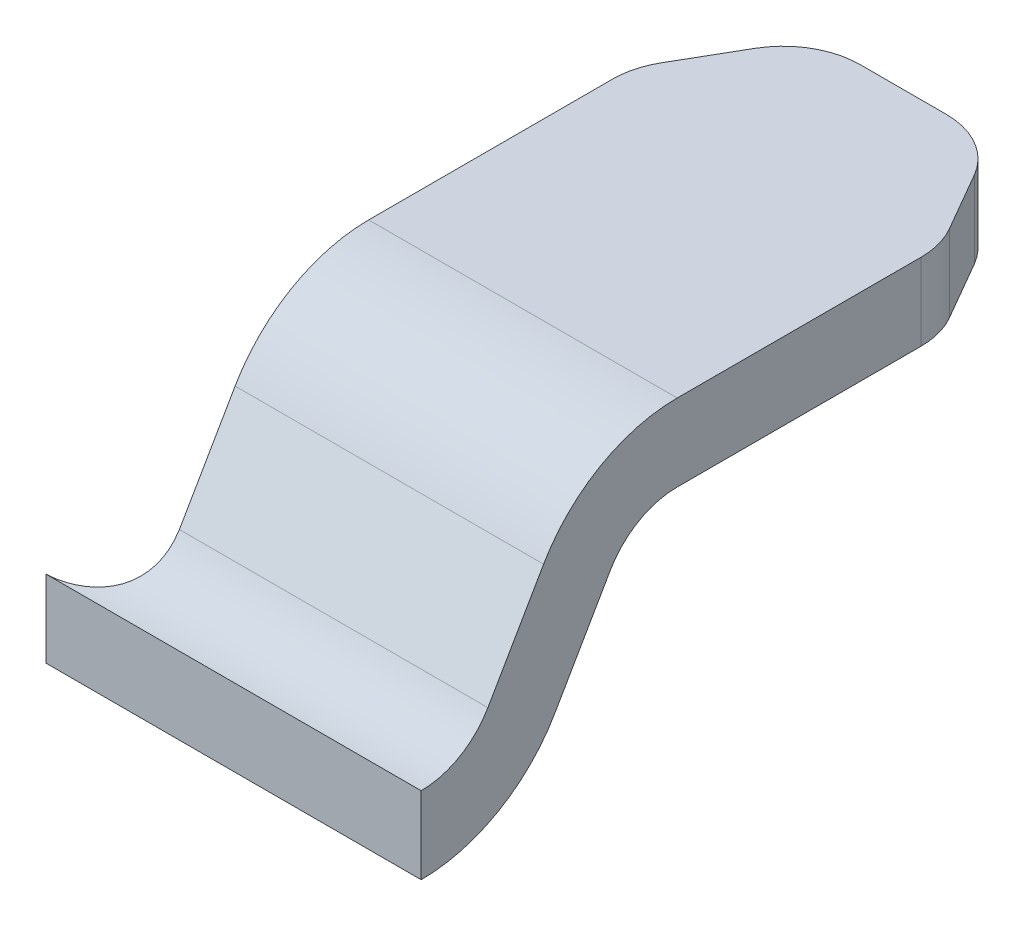
ISO-10303-21;
HEADER;
FILE_DESCRIPTION(('STEP AP214'),'2;1');
FILE_NAME('part.step','',(''),(''),'','','');
FILE_SCHEMA(('AUTOMOTIVE_DESIGN { 1 0 10303 214 1 1 1 1 }'));
ENDSEC;
DATA;
#1=APPLICATION_CONTEXT('core data for automotive mechanical design processes');
#2=APPLICATION_PROTOCOL_DEFINITION('international standard','automotive_design',2000,#1);
#3=PRODUCT_CONTEXT('',#1,'mechanical');
#4=PRODUCT('Part','Part','',(#3));
#5=PRODUCT_RELATED_PRODUCT_CATEGORY('part','',(#4));
#6=PRODUCT_DEFINITION_FORMATION('','',#4);
#7=PRODUCT_DEFINITION_CONTEXT('part definition',#1,'design');
#8=PRODUCT_DEFINITION('design','',#6,#7);
#9=PRODUCT_DEFINITION_SHAPE('','',#8);
#10=(LENGTH_UNIT() NAMED_UNIT(*) SI_UNIT(.MILLI.,.METRE.));
#11=(NAMED_UNIT(*) PLANE_ANGLE_UNIT() SI_UNIT($,.RADIAN.));
#12=(NAMED_UNIT(*) SI_UNIT($,.STERADIAN.) SOLID_ANGLE_UNIT());
#13=UNCERTAINTY_MEASURE_WITH_UNIT(LENGTH_MEASURE(1.E-05),#10,'distance_accuracy_value','');
#14=(GEOMETRIC_REPRESENTATION_CONTEXT(3) GLOBAL_UNCERTAINTY_ASSIGNED_CONTEXT((#13)) GLOBAL_UNIT_ASSIGNED_CONTEXT((#10,
#11,#12)) REPRESENTATION_CONTEXT('',''));
#15=CARTESIAN_POINT('',(0.,0.,0.));
#16=DIRECTION('',(0.,0.,1.));
#17=DIRECTION('',(1.,0.,0.));
#18=AXIS2_PLACEMENT_3D('',#15,#16,#17);
#19=CARTESIAN_POINT('',(-8.499968942605,3.500000000009,-3.65014050948));
#20=DIRECTION('',(0.,-2.126490095122E-11,1.));
#21=DIRECTION('',(0.,-1.,-2.126490095122E-11));
#22=AXIS2_PLACEMENT_3D('',#19,#20,#21);
#23=PLANE('',#22);
#24=DIRECTION('',(-2.263504939037E-11,1.,0.));
#25=VECTOR('',#24,1.);
#26=CARTESIAN_POINT('',(-8.499968942605,3.500000000008,-3.650140509429));
#27=LINE('',#26,#25);
#28=CARTESIAN_POINT('',(-8.49996894266812,5.95000004938576,-3.650140509429));
#29=VERTEX_POINT('',#28);
#30=CARTESIAN_POINT('',(-8.49996894266426,5.75000002470708,-3.650140509429));
#31=VERTEX_POINT('',#30);
#32=EDGE_CURVE('E410',#29,#31,#27,.F.);
#33=ORIENTED_EDGE('',*,*,#32,.F.);
#34=DIRECTION('',(-1.,-3.551554605963E-11,1.351452283416E-12));
#35=VECTOR('',#34,1.);
#36=CARTESIAN_POINT('',(-6.3999689427069,5.95000004946034,-3.65014050943184));
#37=LINE('',#36,#35);
#38=CARTESIAN_POINT('',(-9.47285812874747,5.9500000493512,-3.6501405094277));
#39=VERTEX_POINT('',#38);
#40=EDGE_CURVE('E439',#29,#39,#37,.T.);
#41=ORIENTED_EDGE('',*,*,#40,.T.);
#42=DIRECTION('',(-2.263504939037E-11,1.,2.126490095122E-11));
#43=VECTOR('',#42,1.);
#44=CARTESIAN_POINT('',(-9.47285812869157,3.49999999994734,-3.65014050947982));
#45=LINE('',#44,#43);
#46=CARTESIAN_POINT('',(-9.47285812879673,5.75000002467253,-3.65014050942983));
#47=VERTEX_POINT('',#46);
#48=EDGE_CURVE('E157',#39,#47,#45,.F.);
#49=ORIENTED_EDGE('',*,*,#48,.T.);
#50=DIRECTION('',(-1.,-3.551554605963E-11,1.351452283416E-12));
#51=VECTOR('',#50,1.);
#52=CARTESIAN_POINT('',(-6.39996894269979,5.75000002478167,-3.65014050943184));
#53=LINE('',#52,#51);
#54=EDGE_CURVE('E158',#31,#47,#53,.T.);
#55=ORIENTED_EDGE('',*,*,#54,.F.);
#56=EDGE_LOOP('',(#33,#41,#49,#55));
#57=FACE_BOUND('',#56,.T.);
#58=ADVANCED_FACE('F17',(#57),#23,.T.);
#59=CARTESIAN_POINT('',(-6.399968942714,6.150000000103,-3.649999999884));
#60=DIRECTION('',(-1.,-3.551554605963E-11,1.351452283416E-12));
#61=DIRECTION('',(3.551554605963E-11,-1.,0.));
#62=AXIS2_PLACEMENT_3D('',#59,#60,#61);
#63=CYLINDRICAL_SURFACE('',#62,0.2);
#64=CARTESIAN_POINT('',(-8.49996894268032,6.15000000002842,-3.64999999988116));
#65=DIRECTION('',(-1.,-3.551554605963E-11,1.351452283416E-12));
#66=DIRECTION('',(3.551554605963E-11,-1.,0.));
#67=AXIS2_PLACEMENT_3D('',#64,#65,#66);
#68=CIRCLE('',#67,0.2);
#69=CARTESIAN_POINT('',(-8.49996894266986,6.0500000000187,-3.82320508063239));
#70=VERTEX_POINT('',#69);
#71=EDGE_CURVE('E143',#70,#29,#68,.T.);
#72=ORIENTED_EDGE('',*,*,#71,.F.);
#73=DIRECTION('',(1.,8.29369051018556E-12,1.43650933458926E-11));
#74=VECTOR('',#73,1.);
#75=CARTESIAN_POINT('',(-6.399968942714,6.05000000002613,-3.82320508059621));
#76=LINE('',#75,#74);
#77=CARTESIAN_POINT('',(-9.3000972409636,6.05000000000201,-3.82320508063798));
#78=VERTEX_POINT('',#77);
#79=EDGE_CURVE('E137',#78,#70,#76,.T.);
#80=ORIENTED_EDGE('',*,*,#79,.F.);
#81=CARTESIAN_POINT('',(-9.3000972409636,6.05000000000194,-3.82320508063809));
#82=CARTESIAN_POINT('',(-9.30027779439035,6.04180177501271,-3.81848809116702));
#83=CARTESIAN_POINT('',(-9.30066283096507,6.03393993950661,-3.81315869651857));
#84=CARTESIAN_POINT('',(-9.30214723236842,6.01904413826436,-3.80145713343584));
#85=CARTESIAN_POINT('',(-9.3032504915967,6.01201493433625,-3.79507942250675));
#86=CARTESIAN_POINT('',(-9.30649046032377,5.99899691891083,-3.78148134066467));
#87=CARTESIAN_POINT('',(-9.30863295384659,5.99301418836033,-3.77425642722463));
#88=CARTESIAN_POINT('',(-9.3142023002448,5.98232745372478,-3.75940348178767));
#89=CARTESIAN_POINT('',(-9.31762437883303,5.97761880706601,-3.75177703771975));
#90=CARTESIAN_POINT('',(-9.32542139363572,5.96994317187639,-3.73740073780641));
#91=CARTESIAN_POINT('',(-9.32965501973012,5.96684365907458,-3.73064448068721));
#92=CARTESIAN_POINT('',(-9.3392030952169,5.9616108061845,-3.71752405957299));
#93=CARTESIAN_POINT('',(-9.34451865348358,5.95947846464923,-3.7111603066462));
#94=CARTESIAN_POINT('',(-9.35592005902885,5.9560814143098,-3.69931966641387));
#95=CARTESIAN_POINT('',(-9.36197591301185,5.95479119005982,-3.69382095875209));
#96=CARTESIAN_POINT('',(-9.37483738683615,5.95278523118169,-3.68366281258479));
#97=CARTESIAN_POINT('',(-9.38164317311375,5.95206962437452,-3.67900356099108));
#98=CARTESIAN_POINT('',(-9.39658011011515,5.95097066746392,-3.67022236671521));
#99=CARTESIAN_POINT('',(-9.40477558921807,5.95062901378787,-3.66620482906179));
#100=CARTESIAN_POINT('',(-9.42168455453759,5.95019483442756,-3.65945448749895));
#101=CARTESIAN_POINT('',(-9.43039795717187,5.95010226865656,-3.65672147692365));
#102=CARTESIAN_POINT('',(-9.44478047300794,5.95002455662212,-3.65338200668173));
#103=CARTESIAN_POINT('',(-9.45035692253173,5.95001204890543,-3.65236224213044));
#104=CARTESIAN_POINT('',(-9.46157083672554,5.95000087516357,-3.65085347021189));
#105=CARTESIAN_POINT('',(-9.46720817176206,5.95000218396852,-3.65036349950232));
#106=CARTESIAN_POINT('',(-9.47285812874703,5.9500000493512,-3.65014050942772));
#107=B_SPLINE_CURVE_WITH_KNOTS('',3,(#81,#82,#83,#84,#85,#86,#87,#88,#89,#90,#91,#92,#93,#94,
#95,#96,#97,#98,#99,#100,#101,#102,#103,#104,#105,#106),.UNSPECIFIED.,.F.,.F.,(4,2,2,2,2,2,2,2,
2,2,2,2,4),(0.,0.0283828798518243,0.0569209558912545,0.0856197199951394,0.114212457001874,
0.139742802926123,0.165299447910802,0.190040561555783,0.214787177223679,0.242076610262615,
0.26936165123619,0.286345287766869,0.303297990165134),.UNSPECIFIED.);
#108=EDGE_CURVE('E20',#78,#39,#107,.T.);
#109=ORIENTED_EDGE('',*,*,#108,.T.);
#110=ORIENTED_EDGE('',*,*,#40,.F.);
#111=EDGE_LOOP('',(#72,#80,#109,#110));
#112=FACE_BOUND('',#111,.T.);
#113=ADVANCED_FACE('F139',(#112),#63,.F.);
#114=CARTESIAN_POINT('',(-6.399968942714,6.100000000103,-4.313952809452));
#115=DIRECTION('',(-1.,-3.551554605963E-11,1.351452283416E-12));
#116=DIRECTION('',(3.551554605963E-11,-1.,0.));
#117=AXIS2_PLACEMENT_3D('',#114,#115,#116);
#118=CYLINDRICAL_SURFACE('',#117,0.4);
#119=DIRECTION('',(-1.,-3.551554605963E-11,0.));
#120=VECTOR('',#119,1.);
#121=CARTESIAN_POINT('',(-6.399968942714,6.50000000010272,-4.31395280947));
#122=LINE('',#121,#120);
#123=CARTESIAN_POINT('',(-9.29996894267896,6.50000000000143,-4.31395280945904));
#124=VERTEX_POINT('',#123);
#125=CARTESIAN_POINT('',(-8.49996894268224,6.50000000003328,-4.31395280945958));
#126=VERTEX_POINT('',#125);
#127=EDGE_CURVE('E164',#124,#126,#122,.F.);
#128=ORIENTED_EDGE('',*,*,#127,.F.);
#129=CARTESIAN_POINT('',(-9.29996894267179,6.10000000000001,-4.31395280944808));
#130=DIRECTION('',(-1.,-3.551554605963E-11,1.351452283416E-12));
#131=DIRECTION('',(3.551554605963E-11,-1.,0.));
#132=AXIS2_PLACEMENT_3D('',#129,#130,#131);
#133=CIRCLE('',#132,0.4);
#134=CARTESIAN_POINT('',(-9.29996894267843,6.30000000001457,-3.96754264794256));
#135=VERTEX_POINT('',#134);
#136=EDGE_CURVE('E396',#135,#124,#133,.T.);
#137=ORIENTED_EDGE('',*,*,#136,.F.);
#138=DIRECTION('',(1.,8.29369051018556E-12,1.43650933458926E-11));
#139=VECTOR('',#138,1.);
#140=CARTESIAN_POINT('',(-6.399968942714,6.30000000004427,-3.96754264790409));
#141=LINE('',#140,#139);
#142=CARTESIAN_POINT('',(-8.49996894267619,6.30000000002692,-3.96754264793413));
#143=VERTEX_POINT('',#142);
#144=EDGE_CURVE('E148',#143,#135,#141,.F.);
#145=ORIENTED_EDGE('',*,*,#144,.F.);
#146=CARTESIAN_POINT('',(-8.49996894267736,6.10000000002842,-4.31395280944916));
#147=DIRECTION('',(-1.,-3.551554605963E-11,1.351452283416E-12));
#148=DIRECTION('',(3.551554605963E-11,-1.,0.));
#149=AXIS2_PLACEMENT_3D('',#146,#147,#148);
#150=CIRCLE('',#149,0.4);
#151=EDGE_CURVE('E403',#126,#143,#150,.F.);
#152=ORIENTED_EDGE('',*,*,#151,.F.);
#153=EDGE_LOOP('',(#128,#137,#145,#152));
#154=FACE_BOUND('',#153,.T.);
#155=ADVANCED_FACE('F186',(#154),#118,.T.);
#156=CARTESIAN_POINT('',(-6.399968942714,5.950000000103,-3.996410161398));
#157=DIRECTION('',(1.65873810203699E-11,-0.499999999999899,-0.866025403784497));
#158=DIRECTION('',(0.,0.866025403784497,-0.499999999999899));
#159=AXIS2_PLACEMENT_3D('',#156,#157,#158);
#160=PLANE('',#159);
#161=DIRECTION('',(-1.,-3.551554605963E-11,1.351452283416E-12));
#162=VECTOR('',#161,1.);
#163=CARTESIAN_POINT('',(-6.39996894270736,5.95000000010811,-3.99641016140072));
#164=LINE('',#163,#162);
#165=CARTESIAN_POINT('',(-9.29996894266563,5.95000000000225,-3.99641016139534));
#166=VERTEX_POINT('',#165);
#167=CARTESIAN_POINT('',(-8.49996894266773,5.95000000002876,-3.99641016139544));
#168=VERTEX_POINT('',#167);
#169=EDGE_CURVE('E437',#166,#168,#164,.F.);
#170=ORIENTED_EDGE('',*,*,#169,.F.);
#171=DIRECTION('',(1.96022008841507E-11,-0.866025403783781,0.500000000001139));
#172=VECTOR('',#171,1.);
#173=CARTESIAN_POINT('',(-9.29996894266512,6.200000000007,-4.140747728696));
#174=LINE('',#173,#172);
#175=CARTESIAN_POINT('',(-9.29996894268266,6.20000000000717,-4.14074772869571));
#176=VERTEX_POINT('',#175);
#177=EDGE_CURVE('E392',#176,#166,#174,.T.);
#178=ORIENTED_EDGE('',*,*,#177,.F.);
#179=DIRECTION('',(-1.,-3.551554605963E-11,1.351452283416E-12));
#180=VECTOR('',#179,1.);
#181=CARTESIAN_POINT('',(-6.39996894271732,6.20000000011033,-4.14074772869934));
#182=LINE('',#181,#180);
#183=CARTESIAN_POINT('',(-8.49996894268206,6.20000000002987,-4.14074772869325));
#184=VERTEX_POINT('',#183);
#185=EDGE_CURVE('E400',#176,#184,#182,.F.);
#186=ORIENTED_EDGE('',*,*,#185,.T.);
#187=DIRECTION('',(-1.96022008843363E-11,0.866025403785049,-0.499999999998943));
#188=VECTOR('',#187,1.);
#189=CARTESIAN_POINT('',(-8.49996894266046,5.950000000024,-3.996410161393));
#190=LINE('',#189,#188);
#191=EDGE_CURVE('E409',#168,#184,#190,.T.);
#192=ORIENTED_EDGE('',*,*,#191,.F.);
#193=EDGE_LOOP('',(#170,#178,#186,#192));
#194=FACE_BOUND('',#193,.T.);
#195=ADVANCED_FACE('F182',(#194),#160,.T.);
#196=CARTESIAN_POINT('',(-6.399968942714,6.150000000103,-3.649999999884));
#197=DIRECTION('',(-1.,-3.551554605963E-11,1.351452283416E-12));
#198=DIRECTION('',(3.551554605963E-11,-1.,0.));
#199=AXIS2_PLACEMENT_3D('',#196,#197,#198);
#200=CYLINDRICAL_SURFACE('',#199,0.4);
#201=CARTESIAN_POINT('',(-9.47285812874499,5.75000002467253,-3.65014050943187));
#202=CARTESIAN_POINT('',(-9.4627690392564,5.75001060580209,-3.65053078995445));
#203=CARTESIAN_POINT('',(-9.45271634494505,5.75000131045122,-3.65178649992532));
#204=CARTESIAN_POINT('',(-9.43296313150003,5.75003615282917,-3.65595551333938));
#205=CARTESIAN_POINT('',(-9.42326252598787,5.75008027735987,-3.65886840725865));
#206=CARTESIAN_POINT('',(-9.40448151002414,5.75031513508185,-3.66628119837156));
#207=CARTESIAN_POINT('',(-9.39540150715223,5.75050596363218,-3.67078212677313));
#208=CARTESIAN_POINT('',(-9.37813281158542,5.75118691255975,-3.68123457741161));
#209=CARTESIAN_POINT('',(-9.36994387989525,5.75167695245087,-3.68718570929359));
#210=CARTESIAN_POINT('',(-9.35477936131802,5.7531189963216,-3.70028157227595));
#211=CARTESIAN_POINT('',(-9.34779191225092,5.75406608436189,-3.7074130829485));
#212=CARTESIAN_POINT('',(-9.33513443181458,5.75657975828739,-3.72266387303066));
#213=CARTESIAN_POINT('',(-9.3294637277814,5.75814602675194,-3.73078264485005));
#214=CARTESIAN_POINT('',(-9.31975481422064,5.7619519502913,-3.74741086685393));
#215=CARTESIAN_POINT('',(-9.31566710526881,5.76416655464111,-3.75589723044443));
#216=CARTESIAN_POINT('',(-9.30891074035316,5.76934068635508,-3.77320722318115));
#217=CARTESIAN_POINT('',(-9.30624280403431,5.77230059037422,-3.78203102093971));
#218=CARTESIAN_POINT('',(-9.30280779230196,5.77810198593914,-3.79744966016726));
#219=CARTESIAN_POINT('',(-9.30172955371984,5.78078139477875,-3.80403942795247));
#220=CARTESIAN_POINT('',(-9.30031011532164,5.78651203838595,-3.81711642866073));
#221=CARTESIAN_POINT('',(-9.29996701674114,5.78956229369722,-3.82360388266987));
#222=CARTESIAN_POINT('',(-9.29996894265495,5.79278857796608,-3.82999999979268));
#223=B_SPLINE_CURVE_WITH_KNOTS('',3,(#201,#202,#203,#204,#205,#206,#207,#208,#209,#210,#211,
#212,#213,#214,#215,#216,#217,#218,#219,#220,#221,#222),.UNSPECIFIED.,.F.,.F.,(4,2,2,2,2,2,2,2,
2,2,4),(0.,0.0302505519788787,0.0604936316753309,0.0907563863081779,0.121011004019699,
0.150947225011804,0.180868119166091,0.209758479597706,0.238663469870064,0.260201633917041,
0.281684100484369),.UNSPECIFIED.);
#224=CARTESIAN_POINT('',(-9.29996894266325,5.79278857796801,-3.82999999979642));
#225=VERTEX_POINT('',#224);
#226=EDGE_CURVE('E149',#47,#225,#223,.T.);
#227=ORIENTED_EDGE('',*,*,#226,.T.);
#228=CARTESIAN_POINT('',(-9.29996894267844,6.15000000000001,-3.64999999988008));
#229=DIRECTION('',(-1.,-3.551554605963E-11,1.351452283416E-12));
#230=DIRECTION('',(3.551554605963E-11,-1.,0.));
#231=AXIS2_PLACEMENT_3D('',#228,#229,#230);
#232=CIRCLE('',#231,0.4);
#233=EDGE_CURVE('E389',#166,#225,#232,.T.);
#234=ORIENTED_EDGE('',*,*,#233,.F.);
#235=ORIENTED_EDGE('',*,*,#169,.T.);
#236=CARTESIAN_POINT('',(-8.49996894268164,6.15000000002842,-3.64999999988116));
#237=DIRECTION('',(-1.,-3.551554605963E-11,1.351452283416E-12));
#238=DIRECTION('',(3.551554605963E-11,-1.,0.));
#239=AXIS2_PLACEMENT_3D('',#236,#237,#238);
#240=CIRCLE('',#239,0.4);
#241=EDGE_CURVE('E407',#31,#168,#240,.F.);
#242=ORIENTED_EDGE('',*,*,#241,.F.);
#243=ORIENTED_EDGE('',*,*,#54,.T.);
#244=EDGE_LOOP('',(#227,#234,#235,#242,#243));
#245=FACE_BOUND('',#244,.T.);
#246=ADVANCED_FACE('F178',(#245),#200,.T.);
#247=CARTESIAN_POINT('',(-9.479968942604,3.499999999951,-3.829999999987));
#248=DIRECTION('',(-2.263504939037E-11,1.,2.126490095122E-11));
#249=DIRECTION('',(-1.,-2.263504939037E-11,0.));
#250=AXIS2_PLACEMENT_3D('',#247,#248,#249);
#251=CYLINDRICAL_SURFACE('',#250,0.18);
#252=DIRECTION('',(2.263504939037E-11,-1.,0.));
#253=VECTOR('',#252,1.);
#254=CARTESIAN_POINT('',(-9.299968942604,3.499999999951,-3.8299999998));
#255=LINE('',#254,#253);
#256=CARTESIAN_POINT('',(-9.29996894266199,6.06176914533899,-3.82999999986626));
#257=VERTEX_POINT('',#256);
#258=EDGE_CURVE('E385',#225,#257,#255,.F.);
#259=ORIENTED_EDGE('',*,*,#258,.F.);
#260=ORIENTED_EDGE('',*,*,#226,.F.);
#261=ORIENTED_EDGE('',*,*,#48,.F.);
#262=ORIENTED_EDGE('',*,*,#108,.F.);
#263=CARTESIAN_POINT('',(-9.47996894266199,6.06176914544779,-3.82999999993252));
#264=DIRECTION('',(-1.65873810203706E-11,0.500000000000017,0.866025403784429));
#265=DIRECTION('',(-1.65599748198898E-11,0.866025403784429,-0.500000000000017));
#266=AXIS2_PLACEMENT_3D('',#263,#264,#265);
#267=ELLIPSE('',#266,0.359999999986728,0.18);
#268=EDGE_CURVE('E154',#257,#78,#267,.F.);
#269=ORIENTED_EDGE('',*,*,#268,.F.);
#270=EDGE_LOOP('',(#259,#260,#261,#262,#269));
#271=FACE_BOUND('',#270,.T.);
#272=ADVANCED_FACE('F153',(#271),#251,.F.);
#273=CARTESIAN_POINT('',(-6.399968942714,6.300000000103,-3.967542647938));
#274=DIRECTION('',(-1.65873810203706E-11,0.500000000000017,0.866025403784429));
#275=DIRECTION('',(0.,-0.866025403784429,0.500000000000017));
#276=AXIS2_PLACEMENT_3D('',#273,#274,#275);
#277=PLANE('',#276);
#278=DIRECTION('',(-1.95994502057971E-11,0.866025403742388,-0.500000000072834));
#279=VECTOR('',#278,1.);
#280=CARTESIAN_POINT('',(-9.29996894266199,6.061769145378,-3.829999999862));
#281=LINE('',#280,#279);
#282=EDGE_CURVE('E162',#257,#135,#281,.T.);
#283=ORIENTED_EDGE('',*,*,#282,.F.);
#284=ORIENTED_EDGE('',*,*,#268,.T.);
#285=ORIENTED_EDGE('',*,*,#79,.T.);
#286=DIRECTION('',(1.96022008845806E-11,-0.86602540378545,0.499999999998248));
#287=VECTOR('',#286,1.);
#288=CARTESIAN_POINT('',(-8.49996894266838,6.300000000027,-3.967542647934));
#289=LINE('',#288,#287);
#290=EDGE_CURVE('E402',#143,#70,#289,.T.);
#291=ORIENTED_EDGE('',*,*,#290,.F.);
#292=ORIENTED_EDGE('',*,*,#144,.T.);
#293=EDGE_LOOP('',(#283,#284,#285,#291,#292));
#294=FACE_BOUND('',#293,.T.);
#295=ADVANCED_FACE('F159',(#294),#277,.T.);
#296=CARTESIAN_POINT('',(-6.399968942714,6.500000000103,-5.399999999884));
#297=DIRECTION('',(-3.551554605963E-11,1.,2.614766152764E-13));
#298=DIRECTION('',(-1.,-3.551554605963E-11,0.));
#299=AXIS2_PLACEMENT_3D('',#296,#297,#298);
#300=PLANE('',#299);
#301=CARTESIAN_POINT('',(-9.09996894267191,6.50000000001553,-4.94641016143721));
#302=DIRECTION('',(-2.263504939037E-11,1.,2.126490095122E-11));
#303=DIRECTION('',(-1.,-2.263504939037E-11,0.));
#304=AXIS2_PLACEMENT_3D('',#301,#302,#303);
#305=CIRCLE('',#304,0.2);
#306=CARTESIAN_POINT('',(-9.29996894267191,6.5000000000065,-4.9464101614266));
#307=VERTEX_POINT('',#306);
#308=CARTESIAN_POINT('',(-9.27317402342659,6.50000000002237,-5.04641016144113));
#309=VERTEX_POINT('',#308);
#310=EDGE_CURVE('E369',#307,#309,#305,.F.);
#311=ORIENTED_EDGE('',*,*,#310,.F.);
#312=DIRECTION('',(0.,0.,1.));
#313=VECTOR('',#312,1.);
#314=CARTESIAN_POINT('',(-9.29996894267191,6.500000000002,-3.829999999987));
#315=LINE('',#314,#313);
#316=EDGE_CURVE('E371',#124,#307,#315,.F.);
#317=ORIENTED_EDGE('',*,*,#316,.F.);
#318=ORIENTED_EDGE('',*,*,#127,.T.);
#319=DIRECTION('',(0.,0.,1.));
#320=VECTOR('',#319,1.);
#321=CARTESIAN_POINT('',(-8.49996894267291,6.500000000035,-5.046410161501));
#322=LINE('',#321,#320);
#323=CARTESIAN_POINT('',(-8.49996894267291,6.50000000003524,-4.9464101614511));
#324=VERTEX_POINT('',#323);
#325=EDGE_CURVE('E406',#324,#126,#322,.T.);
#326=ORIENTED_EDGE('',*,*,#325,.F.);
#327=CARTESIAN_POINT('',(-8.69996894267291,6.50000000003095,-4.94641016143721));
#328=DIRECTION('',(-2.263504939037E-11,1.,2.126490095122E-11));
#329=DIRECTION('',(-1.,-2.263504939037E-11,0.));
#330=AXIS2_PLACEMENT_3D('',#327,#328,#329);
#331=CIRCLE('',#330,0.2);
#332=CARTESIAN_POINT('',(-8.52676386191499,6.5000000000425,-5.0464101614359));
#333=VERTEX_POINT('',#332);
#334=EDGE_CURVE('E411',#333,#324,#331,.F.);
#335=ORIENTED_EDGE('',*,*,#334,.F.);
#336=DIRECTION('',(-0.49999999999819,0.,-0.866025403785483));
#337=VECTOR('',#336,1.);
#338=CARTESIAN_POINT('',(-8.61543899652055,6.500000000048,-5.19999999994165));
#339=LINE('',#338,#337);
#340=CARTESIAN_POINT('',(-8.61543899651037,6.5000000000399,-5.199999999924));
#341=VERTEX_POINT('',#340);
#342=EDGE_CURVE('E418',#341,#333,#339,.F.);
#343=ORIENTED_EDGE('',*,*,#342,.F.);
#344=CARTESIAN_POINT('',(-8.78864407726691,6.50000000002575,-5.09999999992321));
#345=DIRECTION('',(-2.263504939037E-11,1.,2.126490095122E-11));
#346=DIRECTION('',(-1.,-2.263504939037E-11,0.));
#347=AXIS2_PLACEMENT_3D('',#344,#345,#346);
#348=CIRCLE('',#347,0.2);
#349=CARTESIAN_POINT('',(-8.78864407667927,6.5000000000355,-5.29999999990199));
#350=VERTEX_POINT('',#349);
#351=EDGE_CURVE('E170',#350,#341,#348,.F.);
#352=ORIENTED_EDGE('',*,*,#351,.F.);
#353=DIRECTION('',(-1.,0.,1.351452283416E-12));
#354=VECTOR('',#353,1.);
#355=CARTESIAN_POINT('',(-6.399968942714,6.500000000041,-5.299999999884));
#356=LINE('',#355,#354);
#357=CARTESIAN_POINT('',(-9.0112938089285,6.50000000003202,-5.29999999990184));
#358=VERTEX_POINT('',#357);
#359=EDGE_CURVE('E166',#358,#350,#356,.F.);
#360=ORIENTED_EDGE('',*,*,#359,.F.);
#361=CARTESIAN_POINT('',(-9.01129380807791,6.50000000001879,-5.09999999992321));
#362=DIRECTION('',(-2.263504939037E-11,1.,2.126490095122E-11));
#363=DIRECTION('',(-1.,-2.263504939037E-11,0.));
#364=AXIS2_PLACEMENT_3D('',#361,#362,#363);
#365=CIRCLE('',#364,0.2);
#366=CARTESIAN_POINT('',(-9.18449888883501,6.500000000024,-5.19999999992273));
#367=VERTEX_POINT('',#366);
#368=EDGE_CURVE('E453',#367,#358,#365,.F.);
#369=ORIENTED_EDGE('',*,*,#368,.F.);
#370=DIRECTION('',(-0.499999999998072,0.,0.866025403785552));
#371=VECTOR('',#370,1.);
#372=CARTESIAN_POINT('',(-9.2731740233843,6.500000000031,-5.04641016151446));
#373=LINE('',#372,#371);
#374=EDGE_CURVE('E374',#309,#367,#373,.F.);
#375=ORIENTED_EDGE('',*,*,#374,.F.);
#376=EDGE_LOOP('',(#311,#317,#318,#326,#335,#343,#352,#360,#369,#375));
#377=FACE_BOUND('',#376,.T.);
#378=ADVANCED_FACE('F243',(#377),#300,.T.);
#379=CARTESIAN_POINT('',(-6.399968942714,6.300000000104,-5.299999999884));
#380=DIRECTION('',(-1.351452283416E-12,0.,-1.));
#381=DIRECTION('',(-1.,0.,1.351452283416E-12));
#382=AXIS2_PLACEMENT_3D('',#379,#380,#381);
#383=PLANE('',#382);
#384=DIRECTION('',(1.,3.551554605963E-11,0.));
#385=VECTOR('',#384,1.);
#386=CARTESIAN_POINT('',(-6.399968942714,6.30000000010352,-5.299999999927));
#387=LINE('',#386,#385);
#388=CARTESIAN_POINT('',(-9.01129380847643,6.30000000003639,-5.29999999992712));
#389=VERTEX_POINT('',#388);
#390=CARTESIAN_POINT('',(-8.78864407681219,6.30000000003044,-5.29999999992712));
#391=VERTEX_POINT('',#390);
#392=EDGE_CURVE('E452',#389,#391,#387,.T.);
#393=ORIENTED_EDGE('',*,*,#392,.F.);
#394=DIRECTION('',(-2.263504939037E-11,1.,2.126490095122E-11));
#395=VECTOR('',#394,1.);
#396=CARTESIAN_POINT('',(-9.01129380881609,3.50000000001225,-5.299999999987));
#397=LINE('',#396,#395);
#398=EDGE_CURVE('E432',#358,#389,#397,.F.);
#399=ORIENTED_EDGE('',*,*,#398,.F.);
#400=ORIENTED_EDGE('',*,*,#359,.T.);
#401=DIRECTION('',(-2.263504939037E-11,1.,2.126490095122E-11));
#402=VECTOR('',#401,1.);
#403=CARTESIAN_POINT('',(-8.78864407629862,3.50000000001225,-5.299999999987));
#404=LINE('',#403,#402);
#405=EDGE_CURVE('E428',#391,#350,#404,.T.);
#406=ORIENTED_EDGE('',*,*,#405,.F.);
#407=EDGE_LOOP('',(#393,#399,#400,#406));
#408=FACE_BOUND('',#407,.T.);
#409=ADVANCED_FACE('F239',(#408),#383,.T.);
#410=CARTESIAN_POINT('',(-8.788644077199,3.500000000008,-5.099999999987));
#411=DIRECTION('',(-2.263504939037E-11,1.,2.126490095122E-11));
#412=DIRECTION('',(-1.,-2.263504939037E-11,0.));
#413=AXIS2_PLACEMENT_3D('',#410,#411,#412);
#414=CYLINDRICAL_SURFACE('',#413,0.2);
#415=ORIENTED_EDGE('',*,*,#405,.T.);
#416=ORIENTED_EDGE('',*,*,#351,.T.);
#417=DIRECTION('',(-2.61842592591617E-11,1.,1.5117489131735E-11));
#418=VECTOR('',#417,1.);
#419=CARTESIAN_POINT('',(-8.61543899643245,3.500000000008,-5.19999999997046));
#420=LINE('',#419,#418);
#421=CARTESIAN_POINT('',(-8.61543899650589,6.30000000003439,-5.19999999992807));
#422=VERTEX_POINT('',#421);
#423=EDGE_CURVE('E421',#422,#341,#420,.T.);
#424=ORIENTED_EDGE('',*,*,#423,.F.);
#425=CARTESIAN_POINT('',(-8.78864407726238,6.30000000003795,-5.09999999992746));
#426=DIRECTION('',(-2.263504939037E-11,1.,2.126490095122E-11));
#427=DIRECTION('',(-1.,-2.263504939037E-11,0.));
#428=AXIS2_PLACEMENT_3D('',#425,#426,#427);
#429=CIRCLE('',#428,0.2);
#430=EDGE_CURVE('E450',#391,#422,#429,.F.);
#431=ORIENTED_EDGE('',*,*,#430,.F.);
#432=EDGE_LOOP('',(#415,#416,#424,#431));
#433=FACE_BOUND('',#432,.T.);
#434=ADVANCED_FACE('F235',(#433),#414,.T.);
#435=CARTESIAN_POINT('',(-8.615438996442,3.500000000008,-5.199999999987));
#436=DIRECTION('',(0.866025403785483,3.02349782635794E-11,-0.49999999999819));
#437=DIRECTION('',(-0.49999999999819,0.,-0.866025403785483));
#438=AXIS2_PLACEMENT_3D('',#435,#436,#437);
#439=PLANE('',#438);
#440=ORIENTED_EDGE('',*,*,#423,.T.);
#441=ORIENTED_EDGE('',*,*,#342,.T.);
#442=DIRECTION('',(-2.263504939037E-11,1.,2.126490095122E-11));
#443=VECTOR('',#442,1.);
#444=CARTESIAN_POINT('',(-8.52676386184667,3.50000000001405,-5.04641016149851));
#445=LINE('',#444,#443);
#446=CARTESIAN_POINT('',(-8.52676386191063,6.30000000003669,-5.04641016144006));
#447=VERTEX_POINT('',#446);
#448=EDGE_CURVE('E412',#447,#333,#445,.T.);
#449=ORIENTED_EDGE('',*,*,#448,.F.);
#450=DIRECTION('',(0.499999999998246,1.73080830647458E-11,0.866025403785451));
#451=VECTOR('',#450,1.);
#452=CARTESIAN_POINT('',(-8.615438996506,6.30000000002478,-5.199999999928));
#453=LINE('',#452,#451);
#454=EDGE_CURVE('E449',#422,#447,#453,.T.);
#455=ORIENTED_EDGE('',*,*,#454,.F.);
#456=EDGE_LOOP('',(#440,#441,#449,#455));
#457=FACE_BOUND('',#456,.T.);
#458=ADVANCED_FACE('F231',(#457),#439,.T.);
#459=CARTESIAN_POINT('',(-8.699968942605,3.500000000008,-4.946410161501));
#460=DIRECTION('',(-2.263504939037E-11,1.,2.126490095122E-11));
#461=DIRECTION('',(-1.,-2.263504939037E-11,0.));
#462=AXIS2_PLACEMENT_3D('',#459,#460,#461);
#463=CYLINDRICAL_SURFACE('',#462,0.2);
#464=ORIENTED_EDGE('',*,*,#448,.T.);
#465=ORIENTED_EDGE('',*,*,#334,.T.);
#466=DIRECTION('',(-2.263504939037E-11,1.,0.));
#467=VECTOR('',#466,1.);
#468=CARTESIAN_POINT('',(-8.499968942605,3.500000000008,-4.946410161465));
#469=LINE('',#468,#467);
#470=CARTESIAN_POINT('',(-8.49996894266959,6.30000000003637,-4.94641016145323));
#471=VERTEX_POINT('',#470);
#472=EDGE_CURVE('E425',#471,#324,#469,.T.);
#473=ORIENTED_EDGE('',*,*,#472,.F.);
#474=CARTESIAN_POINT('',(-8.69996894266838,6.30000000003947,-4.94641016144146));
#475=DIRECTION('',(-2.263504939037E-11,1.,2.126490095122E-11));
#476=DIRECTION('',(-1.,-2.263504939037E-11,0.));
#477=AXIS2_PLACEMENT_3D('',#474,#475,#476);
#478=CIRCLE('',#477,0.2);
#479=EDGE_CURVE('E445',#447,#471,#478,.F.);
#480=ORIENTED_EDGE('',*,*,#479,.F.);
#481=EDGE_LOOP('',(#464,#465,#473,#480));
#482=FACE_BOUND('',#481,.T.);
#483=ADVANCED_FACE('F227',(#482),#463,.T.);
#484=CARTESIAN_POINT('',(-8.499968942605,3.500000000008,-5.046410161501));
#485=DIRECTION('',(1.,2.263504939037E-11,0.));
#486=DIRECTION('',(-2.263504939037E-11,1.,0.));
#487=AXIS2_PLACEMENT_3D('',#484,#485,#486);
#488=PLANE('',#487);
#489=ORIENTED_EDGE('',*,*,#290,.T.);
#490=ORIENTED_EDGE('',*,*,#71,.T.);
#491=ORIENTED_EDGE('',*,*,#32,.T.);
#492=ORIENTED_EDGE('',*,*,#241,.T.);
#493=ORIENTED_EDGE('',*,*,#191,.T.);
#494=CARTESIAN_POINT('',(-8.49996894269468,6.10000000002842,-4.31395280944916));
#495=DIRECTION('',(-1.,-3.551554605963E-11,1.351452283416E-12));
#496=DIRECTION('',(3.551554605963E-11,-1.,0.));
#497=AXIS2_PLACEMENT_3D('',#494,#495,#496);
#498=CIRCLE('',#497,0.2);
#499=CARTESIAN_POINT('',(-8.49996894268589,6.30000000002842,-4.31395280946253));
#500=VERTEX_POINT('',#499);
#501=EDGE_CURVE('E398',#184,#500,#498,.T.);
#502=ORIENTED_EDGE('',*,*,#501,.T.);
#503=DIRECTION('',(0.,-5.231752751578E-13,1.));
#504=VECTOR('',#503,1.);
#505=CARTESIAN_POINT('',(-8.49996894267,6.30000000002842,-4.313952809452));
#506=LINE('',#505,#504);
#507=EDGE_CURVE('E448',#471,#500,#506,.T.);
#508=ORIENTED_EDGE('',*,*,#507,.F.);
#509=ORIENTED_EDGE('',*,*,#472,.T.);
#510=ORIENTED_EDGE('',*,*,#325,.T.);
#511=ORIENTED_EDGE('',*,*,#151,.T.);
#512=EDGE_LOOP('',(#489,#490,#491,#492,#493,#502,#508,#509,#510,#511));
#513=FACE_BOUND('',#512,.T.);
#514=ADVANCED_FACE('F223',(#513),#488,.T.);
#515=CARTESIAN_POINT('',(-6.399968942714,6.100000000103,-4.313952809452));
#516=DIRECTION('',(-1.,-3.551554605963E-11,1.351452283416E-12));
#517=DIRECTION('',(3.551554605963E-11,-1.,0.));
#518=AXIS2_PLACEMENT_3D('',#515,#516,#517);
#519=CYLINDRICAL_SURFACE('',#518,0.2);
#520=ORIENTED_EDGE('',*,*,#501,.F.);
#521=ORIENTED_EDGE('',*,*,#185,.F.);
#522=CARTESIAN_POINT('',(-9.2999689426969,6.10000000000001,-4.31395280944808));
#523=DIRECTION('',(-1.,-3.551554605963E-11,1.351452283416E-12));
#524=DIRECTION('',(3.551554605963E-11,-1.,0.));
#525=AXIS2_PLACEMENT_3D('',#522,#523,#524);
#526=CIRCLE('',#525,0.2);
#527=CARTESIAN_POINT('',(-9.299968942704,6.30000000000001,-4.31395280946199));
#528=VERTEX_POINT('',#527);
#529=EDGE_CURVE('E393',#528,#176,#526,.F.);
#530=ORIENTED_EDGE('',*,*,#529,.F.);
#531=DIRECTION('',(1.,3.551554605963E-11,0.));
#532=VECTOR('',#531,1.);
#533=CARTESIAN_POINT('',(-6.399968942714,6.300000000103,-4.313952809476));
#534=LINE('',#533,#532);
#535=EDGE_CURVE('E466',#500,#528,#534,.F.);
#536=ORIENTED_EDGE('',*,*,#535,.F.);
#537=EDGE_LOOP('',(#520,#521,#530,#536));
#538=FACE_BOUND('',#537,.T.);
#539=ADVANCED_FACE('F219',(#538),#519,.F.);
#540=CARTESIAN_POINT('',(-9.299968942604,3.499999999951,-3.829999999987));
#541=DIRECTION('',(-1.,-2.263504939037E-11,0.));
#542=DIRECTION('',(2.263504939037E-11,-1.,0.));
#543=AXIS2_PLACEMENT_3D('',#540,#541,#542);
#544=PLANE('',#543);
#545=ORIENTED_EDGE('',*,*,#258,.T.);
#546=ORIENTED_EDGE('',*,*,#282,.T.);
#547=ORIENTED_EDGE('',*,*,#136,.T.);
#548=ORIENTED_EDGE('',*,*,#316,.T.);
#549=DIRECTION('',(2.263504939037E-11,-1.,0.));
#550=VECTOR('',#549,1.);
#551=CARTESIAN_POINT('',(-9.299968942604,3.499999999951,-4.946410161416));
#552=LINE('',#551,#550);
#553=CARTESIAN_POINT('',(-9.29996894269484,6.3000000000258,-4.94641016142873));
#554=VERTEX_POINT('',#553);
#555=EDGE_CURVE('E377',#554,#307,#552,.F.);
#556=ORIENTED_EDGE('',*,*,#555,.F.);
#557=DIRECTION('',(0.,-5.231752751578E-13,1.));
#558=VECTOR('',#557,1.);
#559=CARTESIAN_POINT('',(-9.299968942704,6.30000000000001,-4.313952809452));
#560=LINE('',#559,#558);
#561=EDGE_CURVE('E444',#528,#554,#560,.F.);
#562=ORIENTED_EDGE('',*,*,#561,.F.);
#563=ORIENTED_EDGE('',*,*,#529,.T.);
#564=ORIENTED_EDGE('',*,*,#177,.T.);
#565=ORIENTED_EDGE('',*,*,#233,.T.);
#566=EDGE_LOOP('',(#545,#546,#547,#548,#556,#562,#563,#564,#565));
#567=FACE_BOUND('',#566,.T.);
#568=ADVANCED_FACE('F215',(#567),#544,.T.);
#569=CARTESIAN_POINT('',(-9.099968942604,3.500000000008,-4.946410161501));
#570=DIRECTION('',(-2.263504939037E-11,1.,2.126490095122E-11));
#571=DIRECTION('',(-1.,-2.263504939037E-11,0.));
#572=AXIS2_PLACEMENT_3D('',#569,#570,#571);
#573=CYLINDRICAL_SURFACE('',#572,0.2);
#574=ORIENTED_EDGE('',*,*,#555,.T.);
#575=ORIENTED_EDGE('',*,*,#310,.T.);
#576=DIRECTION('',(-7.76831482648784E-12,1.,-4.48503865619946E-12));
#577=VECTOR('',#576,1.);
#578=CARTESIAN_POINT('',(-9.2731740234005,3.500000000008,-5.04641016143259));
#579=LINE('',#578,#577);
#580=CARTESIAN_POINT('',(-9.27317402342212,6.30000000002767,-5.04641016144507));
#581=VERTEX_POINT('',#580);
#582=EDGE_CURVE('E376',#581,#309,#579,.T.);
#583=ORIENTED_EDGE('',*,*,#582,.F.);
#584=CARTESIAN_POINT('',(-9.09996894266738,6.30000000005579,-4.94641016144146));
#585=DIRECTION('',(-2.263504939037E-11,1.,2.126490095122E-11));
#586=DIRECTION('',(-1.,-2.263504939037E-11,0.));
#587=AXIS2_PLACEMENT_3D('',#584,#585,#586);
#588=CIRCLE('',#587,0.2);
#589=EDGE_CURVE('E381',#554,#581,#588,.F.);
#590=ORIENTED_EDGE('',*,*,#589,.F.);
#591=EDGE_LOOP('',(#574,#575,#583,#590));
#592=FACE_BOUND('',#591,.T.);
#593=ADVANCED_FACE('F212',(#592),#573,.T.);
#594=CARTESIAN_POINT('',(-9.273174023361,3.500000000008,-5.046410161501));
#595=DIRECTION('',(-0.866025403785552,-8.9700773124335E-12,-0.499999999998072));
#596=DIRECTION('',(-0.499999999998072,0.,0.866025403785552));
#597=AXIS2_PLACEMENT_3D('',#594,#595,#596);
#598=PLANE('',#597);
#599=ORIENTED_EDGE('',*,*,#582,.T.);
#600=ORIENTED_EDGE('',*,*,#374,.T.);
#601=DIRECTION('',(-2.263504939037E-11,1.,2.126490095122E-11));
#602=VECTOR('',#601,1.);
#603=CARTESIAN_POINT('',(-9.18449888876839,3.50000000000621,-5.19999999998441));
#604=LINE('',#603,#602);
#605=CARTESIAN_POINT('',(-9.18449888883149,6.30000000003026,-5.19999999992575));
#606=VERTEX_POINT('',#605);
#607=EDGE_CURVE('E39',#606,#367,#604,.T.);
#608=ORIENTED_EDGE('',*,*,#607,.F.);
#609=DIRECTION('',(0.499999999994839,1.82079664464456E-11,-0.866025403787418));
#610=VECTOR('',#609,1.);
#611=CARTESIAN_POINT('',(-9.273174023422,6.30000000000134,-5.046410161445));
#612=LINE('',#611,#610);
#613=EDGE_CURVE('E30',#581,#606,#612,.T.);
#614=ORIENTED_EDGE('',*,*,#613,.F.);
#615=EDGE_LOOP('',(#599,#600,#608,#614));
#616=FACE_BOUND('',#615,.T.);
#617=ADVANCED_FACE('F205',(#616),#598,.T.);
#618=CARTESIAN_POINT('',(-9.01129380801,3.500000000008,-5.099999999987));
#619=DIRECTION('',(-2.263504939037E-11,1.,2.126490095122E-11));
#620=DIRECTION('',(-1.,-2.263504939037E-11,0.));
#621=AXIS2_PLACEMENT_3D('',#618,#619,#620);
#622=CYLINDRICAL_SURFACE('',#621,0.2);
#623=ORIENTED_EDGE('',*,*,#607,.T.);
#624=ORIENTED_EDGE('',*,*,#368,.T.);
#625=ORIENTED_EDGE('',*,*,#398,.T.);
#626=CARTESIAN_POINT('',(-9.01129380807338,6.30000000005775,-5.09999999992746));
#627=DIRECTION('',(-2.263504939037E-11,1.,2.126490095122E-11));
#628=DIRECTION('',(-1.,-2.263504939037E-11,0.));
#629=AXIS2_PLACEMENT_3D('',#626,#627,#628);
#630=CIRCLE('',#629,0.2);
#631=EDGE_CURVE('E11',#606,#389,#630,.F.);
#632=ORIENTED_EDGE('',*,*,#631,.F.);
#633=EDGE_LOOP('',(#623,#624,#625,#632));
#634=FACE_BOUND('',#633,.T.);
#635=ADVANCED_FACE('F199',(#634),#622,.T.);
#636=CARTESIAN_POINT('',(-6.399968942714,6.300000000103,-4.313952809452));
#637=DIRECTION('',(3.551554605963E-11,-1.,-5.231752751578E-13));
#638=DIRECTION('',(1.,3.551554605963E-11,0.));
#639=AXIS2_PLACEMENT_3D('',#636,#637,#638);
#640=PLANE('',#639);
#641=ORIENTED_EDGE('',*,*,#613,.T.);
#642=ORIENTED_EDGE('',*,*,#631,.T.);
#643=ORIENTED_EDGE('',*,*,#392,.T.);
#644=ORIENTED_EDGE('',*,*,#430,.T.);
#645=ORIENTED_EDGE('',*,*,#454,.T.);
#646=ORIENTED_EDGE('',*,*,#479,.T.);
#647=ORIENTED_EDGE('',*,*,#507,.T.);
#648=ORIENTED_EDGE('',*,*,#535,.T.);
#649=ORIENTED_EDGE('',*,*,#561,.T.);
#650=ORIENTED_EDGE('',*,*,#589,.T.);
#651=EDGE_LOOP('',(#641,#642,#643,#644,#645,#646,#647,#648,#649,#650));
#652=FACE_BOUND('',#651,.T.);
#653=ADVANCED_FACE('F197',(#652),#640,.T.);
#654=CLOSED_SHELL('',(#58,#113,#155,#195,#246,#272,#295,#378,#409,#434,#458,#483,#514,#539,#568,
#593,#617,#635,#653));
#655=MANIFOLD_SOLID_BREP('B1',#654);
#656=ADVANCED_BREP_SHAPE_REPRESENTATION('',(#18,#655),#14);
#657=SHAPE_DEFINITION_REPRESENTATION(#9,#656);
ENDSEC;
END-ISO-10303-21;
